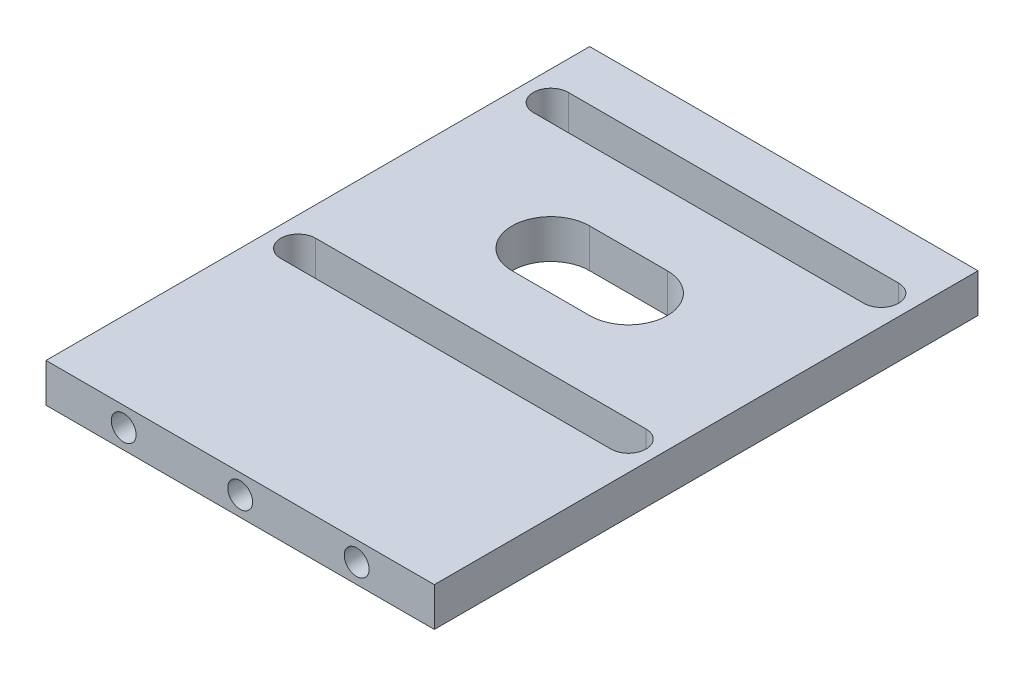
ISO-10303-21;
HEADER;
FILE_DESCRIPTION(('STEP AP214'),'2;1');
FILE_NAME('part.step','',(''),(''),'','','');
FILE_SCHEMA(('AUTOMOTIVE_DESIGN { 1 0 10303 214 1 1 1 1 }'));
ENDSEC;
DATA;
#1=APPLICATION_CONTEXT('core data for automotive mechanical design processes');
#2=APPLICATION_PROTOCOL_DEFINITION('international standard','automotive_design',2000,#1);
#3=PRODUCT_CONTEXT('',#1,'mechanical');
#4=PRODUCT('Part','Part','',(#3));
#5=PRODUCT_RELATED_PRODUCT_CATEGORY('part','',(#4));
#6=PRODUCT_DEFINITION_FORMATION('','',#4);
#7=PRODUCT_DEFINITION_CONTEXT('part definition',#1,'design');
#8=PRODUCT_DEFINITION('design','',#6,#7);
#9=PRODUCT_DEFINITION_SHAPE('','',#8);
#10=(LENGTH_UNIT() NAMED_UNIT(*) SI_UNIT(.MILLI.,.METRE.));
#11=(NAMED_UNIT(*) PLANE_ANGLE_UNIT() SI_UNIT($,.RADIAN.));
#12=(NAMED_UNIT(*) SI_UNIT($,.STERADIAN.) SOLID_ANGLE_UNIT());
#13=UNCERTAINTY_MEASURE_WITH_UNIT(LENGTH_MEASURE(1.E-05),#10,'distance_accuracy_value','');
#14=(GEOMETRIC_REPRESENTATION_CONTEXT(3) GLOBAL_UNCERTAINTY_ASSIGNED_CONTEXT((#13)) GLOBAL_UNIT_ASSIGNED_CONTEXT((#10,
#11,#12)) REPRESENTATION_CONTEXT('',''));
#15=CARTESIAN_POINT('',(0.,0.,0.));
#16=DIRECTION('',(0.,0.,1.));
#17=DIRECTION('',(1.,0.,0.));
#18=AXIS2_PLACEMENT_3D('',#15,#16,#17);
#19=CARTESIAN_POINT('',(0.,5.,0.));
#20=DIRECTION('',(0.,1.,0.));
#21=DIRECTION('',(0.,0.,1.));
#22=AXIS2_PLACEMENT_3D('',#19,#20,#21);
#23=PLANE('',#22);
#24=DIRECTION('',(0.,0.,1.));
#25=VECTOR('',#24,1.);
#26=CARTESIAN_POINT('',(-29.5750744686097,5.,-38.274395374361));
#27=LINE('',#26,#25);
#28=CARTESIAN_POINT('',(-29.5750744686097,5.,-38.274395374361));
#29=VERTEX_POINT('',#28);
#30=CARTESIAN_POINT('',(-29.5750744686097,5.,31.725604625639));
#31=VERTEX_POINT('',#30);
#32=EDGE_CURVE('E289',#29,#31,#27,.T.);
#33=ORIENTED_EDGE('',*,*,#32,.T.);
#34=DIRECTION('',(1.,0.,0.));
#35=VECTOR('',#34,1.);
#36=CARTESIAN_POINT('',(-29.5750744686097,5.,31.725604625639));
#37=LINE('',#36,#35);
#38=CARTESIAN_POINT('',(20.4249255313903,5.,31.725604625639));
#39=VERTEX_POINT('',#38);
#40=EDGE_CURVE('E293',#31,#39,#37,.T.);
#41=ORIENTED_EDGE('',*,*,#40,.T.);
#42=DIRECTION('',(0.,0.,-1.));
#43=VECTOR('',#42,1.);
#44=CARTESIAN_POINT('',(20.4249255313903,5.,-38.274395374361));
#45=LINE('',#44,#43);
#46=CARTESIAN_POINT('',(20.4249255313903,5.,-38.274395374361));
#47=VERTEX_POINT('',#46);
#48=EDGE_CURVE('E297',#39,#47,#45,.T.);
#49=ORIENTED_EDGE('',*,*,#48,.T.);
#50=DIRECTION('',(-1.,0.,0.));
#51=VECTOR('',#50,1.);
#52=CARTESIAN_POINT('',(-29.5750744686097,5.,-38.274395374361));
#53=LINE('',#52,#51);
#54=EDGE_CURVE('E300',#47,#29,#53,.T.);
#55=ORIENTED_EDGE('',*,*,#54,.T.);
#56=EDGE_LOOP('',(#33,#41,#49,#55));
#57=FACE_BOUND('',#56,.T.);
#58=DIRECTION('',(1.,0.,0.));
#59=VECTOR('',#58,1.);
#60=CARTESIAN_POINT('',(-25.8385304359003,5.,-27.2878513416516));
#61=LINE('',#60,#59);
#62=CARTESIAN_POINT('',(-25.8385304359003,5.,-27.2878513416516));
#63=VERTEX_POINT('',#62);
#64=CARTESIAN_POINT('',(16.6883814986808,5.,-27.2878513416516));
#65=VERTEX_POINT('',#64);
#66=EDGE_CURVE('E249',#63,#65,#61,.T.);
#67=ORIENTED_EDGE('',*,*,#66,.F.);
#68=CARTESIAN_POINT('',(-25.8385304359003,5.,-29.5378513416516));
#69=DIRECTION('',(0.,1.,0.));
#70=DIRECTION('',(0.,0.,1.));
#71=AXIS2_PLACEMENT_3D('',#68,#69,#70);
#72=CIRCLE('',#71,2.24999999999999);
#73=CARTESIAN_POINT('',(-25.8385304359003,5.,-31.7878513416516));
#74=VERTEX_POINT('',#73);
#75=EDGE_CURVE('E246',#74,#63,#72,.T.);
#76=ORIENTED_EDGE('',*,*,#75,.F.);
#77=DIRECTION('',(-1.,0.,0.));
#78=VECTOR('',#77,1.);
#79=CARTESIAN_POINT('',(-25.8385304359003,5.,-31.7878513416516));
#80=LINE('',#79,#78);
#81=CARTESIAN_POINT('',(16.6883814986808,5.,-31.7878513416516));
#82=VERTEX_POINT('',#81);
#83=EDGE_CURVE('E257',#82,#74,#80,.T.);
#84=ORIENTED_EDGE('',*,*,#83,.F.);
#85=CARTESIAN_POINT('',(16.6883814986808,5.,-29.5378513416516));
#86=DIRECTION('',(0.,1.,0.));
#87=DIRECTION('',(0.,0.,1.));
#88=AXIS2_PLACEMENT_3D('',#85,#86,#87);
#89=CIRCLE('',#88,2.24999999999999);
#90=EDGE_CURVE('E253',#65,#82,#89,.T.);
#91=ORIENTED_EDGE('',*,*,#90,.F.);
#92=EDGE_LOOP('',(#67,#76,#84,#91));
#93=FACE_BOUND('',#92,.T.);
#94=DIRECTION('',(1.,0.,0.));
#95=VECTOR('',#94,1.);
#96=CARTESIAN_POINT('',(-9.57507446860975,5.,-8.27439537436097));
#97=LINE('',#96,#95);
#98=CARTESIAN_POINT('',(-9.57507446860975,5.,-8.27439537436097));
#99=VERTEX_POINT('',#98);
#100=CARTESIAN_POINT('',(0.424925531390246,5.,-8.27439537436096));
#101=VERTEX_POINT('',#100);
#102=EDGE_CURVE('E206',#99,#101,#97,.T.);
#103=ORIENTED_EDGE('',*,*,#102,.F.);
#104=CARTESIAN_POINT('',(-9.57507446860975,5.,-13.274395374361));
#105=DIRECTION('',(0.,1.,0.));
#106=DIRECTION('',(0.,0.,1.));
#107=AXIS2_PLACEMENT_3D('',#104,#105,#106);
#108=CIRCLE('',#107,5.);
#109=CARTESIAN_POINT('',(-9.57507446860975,5.,-18.274395374361));
#110=VERTEX_POINT('',#109);
#111=EDGE_CURVE('E203',#110,#99,#108,.T.);
#112=ORIENTED_EDGE('',*,*,#111,.F.);
#113=DIRECTION('',(-1.,0.,0.));
#114=VECTOR('',#113,1.);
#115=CARTESIAN_POINT('',(-9.57507446860975,5.,-18.274395374361));
#116=LINE('',#115,#114);
#117=CARTESIAN_POINT('',(0.424925531390245,5.,-18.274395374361));
#118=VERTEX_POINT('',#117);
#119=EDGE_CURVE('E214',#118,#110,#116,.T.);
#120=ORIENTED_EDGE('',*,*,#119,.F.);
#121=CARTESIAN_POINT('',(0.424925531390251,5.,-13.274395374361));
#122=DIRECTION('',(0.,1.,0.));
#123=DIRECTION('',(0.,0.,1.));
#124=AXIS2_PLACEMENT_3D('',#121,#122,#123);
#125=CIRCLE('',#124,5.);
#126=EDGE_CURVE('E210',#101,#118,#125,.T.);
#127=ORIENTED_EDGE('',*,*,#126,.F.);
#128=EDGE_LOOP('',(#103,#112,#120,#127));
#129=FACE_BOUND('',#128,.T.);
#130=DIRECTION('',(1.,0.,0.));
#131=VECTOR('',#130,1.);
#132=CARTESIAN_POINT('',(-25.8385304359003,5.,5.23906059292962));
#133=LINE('',#132,#131);
#134=CARTESIAN_POINT('',(-25.8385304359003,5.,5.23906059292962));
#135=VERTEX_POINT('',#134);
#136=CARTESIAN_POINT('',(16.6883814986808,5.,5.23906059292963));
#137=VERTEX_POINT('',#136);
#138=EDGE_CURVE('E162',#135,#137,#133,.T.);
#139=ORIENTED_EDGE('',*,*,#138,.F.);
#140=CARTESIAN_POINT('',(-25.8385304359003,5.,2.98906059292963));
#141=DIRECTION('',(0.,1.,0.));
#142=DIRECTION('',(0.,0.,-1.));
#143=AXIS2_PLACEMENT_3D('',#140,#141,#142);
#144=CIRCLE('',#143,2.24999999999998);
#145=CARTESIAN_POINT('',(-25.8385304359003,5.,0.73906059292965));
#146=VERTEX_POINT('',#145);
#147=EDGE_CURVE('E153',#146,#135,#144,.T.);
#148=ORIENTED_EDGE('',*,*,#147,.F.);
#149=DIRECTION('',(-1.,0.,0.));
#150=VECTOR('',#149,1.);
#151=CARTESIAN_POINT('',(-25.8385304359003,5.,0.73906059292965));
#152=LINE('',#151,#150);
#153=CARTESIAN_POINT('',(16.6883814986808,5.,0.739060592929643));
#154=VERTEX_POINT('',#153);
#155=EDGE_CURVE('E179',#154,#146,#152,.T.);
#156=ORIENTED_EDGE('',*,*,#155,.F.);
#157=CARTESIAN_POINT('',(16.6883814986808,5.,2.98906059292963));
#158=DIRECTION('',(0.,1.,0.));
#159=DIRECTION('',(0.,0.,-1.));
#160=AXIS2_PLACEMENT_3D('',#157,#158,#159);
#161=CIRCLE('',#160,2.24999999999999);
#162=EDGE_CURVE('E175',#137,#154,#161,.T.);
#163=ORIENTED_EDGE('',*,*,#162,.F.);
#164=EDGE_LOOP('',(#139,#148,#156,#163));
#165=FACE_BOUND('',#164,.T.);
#166=ADVANCED_FACE('F39',(#57,#93,#129,#165),#23,.T.);
#167=CARTESIAN_POINT('',(0.,0.,0.));
#168=DIRECTION('',(0.,1.,0.));
#169=DIRECTION('',(0.,0.,1.));
#170=AXIS2_PLACEMENT_3D('',#167,#168,#169);
#171=PLANE('',#170);
#172=CARTESIAN_POINT('',(-9.57507446860975,0.,-13.274395374361));
#173=DIRECTION('',(0.,1.,0.));
#174=DIRECTION('',(0.,0.,1.));
#175=AXIS2_PLACEMENT_3D('',#172,#173,#174);
#176=CIRCLE('',#175,5.);
#177=CARTESIAN_POINT('',(-9.57507446860975,0.,-18.274395374361));
#178=VERTEX_POINT('',#177);
#179=CARTESIAN_POINT('',(-9.57507446860975,0.,-8.27439537436097));
#180=VERTEX_POINT('',#179);
#181=EDGE_CURVE('E171',#178,#180,#176,.T.);
#182=ORIENTED_EDGE('',*,*,#181,.T.);
#183=DIRECTION('',(1.,0.,0.));
#184=VECTOR('',#183,1.);
#185=CARTESIAN_POINT('',(-9.57507446860975,0.,-8.27439537436097));
#186=LINE('',#185,#184);
#187=CARTESIAN_POINT('',(0.424925531390246,0.,-8.27439537436096));
#188=VERTEX_POINT('',#187);
#189=EDGE_CURVE('E221',#180,#188,#186,.T.);
#190=ORIENTED_EDGE('',*,*,#189,.T.);
#191=CARTESIAN_POINT('',(0.424925531390251,0.,-13.274395374361));
#192=DIRECTION('',(0.,1.,0.));
#193=DIRECTION('',(0.,0.,1.));
#194=AXIS2_PLACEMENT_3D('',#191,#192,#193);
#195=CIRCLE('',#194,5.);
#196=CARTESIAN_POINT('',(0.424925531390245,0.,-18.274395374361));
#197=VERTEX_POINT('',#196);
#198=EDGE_CURVE('E225',#188,#197,#195,.T.);
#199=ORIENTED_EDGE('',*,*,#198,.T.);
#200=DIRECTION('',(-1.,0.,0.));
#201=VECTOR('',#200,1.);
#202=CARTESIAN_POINT('',(-9.57507446860975,0.,-18.274395374361));
#203=LINE('',#202,#201);
#204=EDGE_CURVE('E207',#197,#178,#203,.T.);
#205=ORIENTED_EDGE('',*,*,#204,.T.);
#206=EDGE_LOOP('',(#182,#190,#199,#205));
#207=FACE_BOUND('',#206,.T.);
#208=DIRECTION('',(0.,0.,1.));
#209=VECTOR('',#208,1.);
#210=CARTESIAN_POINT('',(-29.5750744686097,0.,-38.274395374361));
#211=LINE('',#210,#209);
#212=CARTESIAN_POINT('',(-29.5750744686097,0.,-38.274395374361));
#213=VERTEX_POINT('',#212);
#214=CARTESIAN_POINT('',(-29.5750744686097,0.,31.725604625639));
#215=VERTEX_POINT('',#214);
#216=EDGE_CURVE('E288',#213,#215,#211,.T.);
#217=ORIENTED_EDGE('',*,*,#216,.F.);
#218=DIRECTION('',(-1.,0.,0.));
#219=VECTOR('',#218,1.);
#220=CARTESIAN_POINT('',(-29.5750744686097,0.,-38.274395374361));
#221=LINE('',#220,#219);
#222=CARTESIAN_POINT('',(20.4249255313903,0.,-38.274395374361));
#223=VERTEX_POINT('',#222);
#224=EDGE_CURVE('E294',#223,#213,#221,.T.);
#225=ORIENTED_EDGE('',*,*,#224,.F.);
#226=DIRECTION('',(0.,0.,-1.));
#227=VECTOR('',#226,1.);
#228=CARTESIAN_POINT('',(20.4249255313903,0.,-38.274395374361));
#229=LINE('',#228,#227);
#230=CARTESIAN_POINT('',(20.4249255313903,0.,31.725604625639));
#231=VERTEX_POINT('',#230);
#232=EDGE_CURVE('E310',#231,#223,#229,.T.);
#233=ORIENTED_EDGE('',*,*,#232,.F.);
#234=DIRECTION('',(1.,0.,0.));
#235=VECTOR('',#234,1.);
#236=CARTESIAN_POINT('',(-29.5750744686097,0.,31.725604625639));
#237=LINE('',#236,#235);
#238=EDGE_CURVE('E307',#215,#231,#237,.T.);
#239=ORIENTED_EDGE('',*,*,#238,.F.);
#240=EDGE_LOOP('',(#217,#225,#233,#239));
#241=FACE_BOUND('',#240,.T.);
#242=CARTESIAN_POINT('',(-25.8385304359003,0.,-29.5378513416516));
#243=DIRECTION('',(0.,1.,0.));
#244=DIRECTION('',(0.,0.,1.));
#245=AXIS2_PLACEMENT_3D('',#242,#243,#244);
#246=CIRCLE('',#245,2.24999999999999);
#247=CARTESIAN_POINT('',(-25.8385304359003,0.,-31.7878513416516));
#248=VERTEX_POINT('',#247);
#249=CARTESIAN_POINT('',(-25.8385304359003,0.,-27.2878513416516));
#250=VERTEX_POINT('',#249);
#251=EDGE_CURVE('E245',#248,#250,#246,.T.);
#252=ORIENTED_EDGE('',*,*,#251,.T.);
#253=DIRECTION('',(1.,0.,0.));
#254=VECTOR('',#253,1.);
#255=CARTESIAN_POINT('',(-25.8385304359003,0.,-27.2878513416516));
#256=LINE('',#255,#254);
#257=CARTESIAN_POINT('',(16.6883814986808,0.,-27.2878513416516));
#258=VERTEX_POINT('',#257);
#259=EDGE_CURVE('E264',#250,#258,#256,.T.);
#260=ORIENTED_EDGE('',*,*,#259,.T.);
#261=CARTESIAN_POINT('',(16.6883814986808,0.,-29.5378513416516));
#262=DIRECTION('',(0.,1.,0.));
#263=DIRECTION('',(0.,0.,1.));
#264=AXIS2_PLACEMENT_3D('',#261,#262,#263);
#265=CIRCLE('',#264,2.24999999999999);
#266=CARTESIAN_POINT('',(16.6883814986808,0.,-31.7878513416516));
#267=VERTEX_POINT('',#266);
#268=EDGE_CURVE('E268',#258,#267,#265,.T.);
#269=ORIENTED_EDGE('',*,*,#268,.T.);
#270=DIRECTION('',(-1.,0.,0.));
#271=VECTOR('',#270,1.);
#272=CARTESIAN_POINT('',(-25.8385304359003,0.,-31.7878513416516));
#273=LINE('',#272,#271);
#274=EDGE_CURVE('E250',#267,#248,#273,.T.);
#275=ORIENTED_EDGE('',*,*,#274,.T.);
#276=EDGE_LOOP('',(#252,#260,#269,#275));
#277=FACE_BOUND('',#276,.T.);
#278=CARTESIAN_POINT('',(-25.8385304359003,0.,2.98906059292963));
#279=DIRECTION('',(0.,1.,0.));
#280=DIRECTION('',(0.,0.,-1.));
#281=AXIS2_PLACEMENT_3D('',#278,#279,#280);
#282=CIRCLE('',#281,2.24999999999998);
#283=CARTESIAN_POINT('',(-25.8385304359003,0.,0.73906059292965));
#284=VERTEX_POINT('',#283);
#285=CARTESIAN_POINT('',(-25.8385304359003,0.,5.23906059292962));
#286=VERTEX_POINT('',#285);
#287=EDGE_CURVE('E63',#284,#286,#282,.T.);
#288=ORIENTED_EDGE('',*,*,#287,.T.);
#289=DIRECTION('',(1.,0.,0.));
#290=VECTOR('',#289,1.);
#291=CARTESIAN_POINT('',(-25.8385304359003,0.,5.23906059292962));
#292=LINE('',#291,#290);
#293=CARTESIAN_POINT('',(16.6883814986808,0.,5.23906059292963));
#294=VERTEX_POINT('',#293);
#295=EDGE_CURVE('E169',#286,#294,#292,.T.);
#296=ORIENTED_EDGE('',*,*,#295,.T.);
#297=CARTESIAN_POINT('',(16.6883814986808,0.,2.98906059292963));
#298=DIRECTION('',(0.,1.,0.));
#299=DIRECTION('',(0.,0.,-1.));
#300=AXIS2_PLACEMENT_3D('',#297,#298,#299);
#301=CIRCLE('',#300,2.24999999999999);
#302=CARTESIAN_POINT('',(16.6883814986808,0.,0.739060592929643));
#303=VERTEX_POINT('',#302);
#304=EDGE_CURVE('E190',#294,#303,#301,.T.);
#305=ORIENTED_EDGE('',*,*,#304,.T.);
#306=DIRECTION('',(-1.,0.,0.));
#307=VECTOR('',#306,1.);
#308=CARTESIAN_POINT('',(-25.8385304359003,0.,0.73906059292965));
#309=LINE('',#308,#307);
#310=EDGE_CURVE('E163',#303,#284,#309,.T.);
#311=ORIENTED_EDGE('',*,*,#310,.T.);
#312=EDGE_LOOP('',(#288,#296,#305,#311));
#313=FACE_BOUND('',#312,.T.);
#314=ADVANCED_FACE('F333',(#207,#241,#277,#313),#171,.F.);
#315=CARTESIAN_POINT('',(-29.5750744686097,5.,-38.274395374361));
#316=DIRECTION('',(1.,0.,0.));
#317=DIRECTION('',(0.,0.,-1.));
#318=AXIS2_PLACEMENT_3D('',#315,#316,#317);
#319=PLANE('',#318);
#320=ORIENTED_EDGE('',*,*,#216,.T.);
#321=DIRECTION('',(0.,-1.,0.));
#322=VECTOR('',#321,1.);
#323=CARTESIAN_POINT('',(-29.5750744686097,5.,31.725604625639));
#324=LINE('',#323,#322);
#325=EDGE_CURVE('E11',#31,#215,#324,.T.);
#326=ORIENTED_EDGE('',*,*,#325,.F.);
#327=ORIENTED_EDGE('',*,*,#32,.F.);
#328=DIRECTION('',(0.,-1.,0.));
#329=VECTOR('',#328,1.);
#330=CARTESIAN_POINT('',(-29.5750744686097,5.,-38.274395374361));
#331=LINE('',#330,#329);
#332=EDGE_CURVE('E303',#29,#213,#331,.T.);
#333=ORIENTED_EDGE('',*,*,#332,.T.);
#334=EDGE_LOOP('',(#320,#326,#327,#333));
#335=FACE_BOUND('',#334,.T.);
#336=ADVANCED_FACE('F41',(#335),#319,.F.);
#337=CARTESIAN_POINT('',(-29.5750744686097,5.,31.725604625639));
#338=DIRECTION('',(0.,0.,-1.));
#339=DIRECTION('',(-1.,0.,0.));
#340=AXIS2_PLACEMENT_3D('',#337,#338,#339);
#341=PLANE('',#340);
#342=CARTESIAN_POINT('',(10.4249255313903,2.5,31.725604625639));
#343=DIRECTION('',(0.,0.,1.));
#344=DIRECTION('',(-1.,0.,0.));
#345=AXIS2_PLACEMENT_3D('',#342,#343,#344);
#346=CIRCLE('',#345,1.6);
#347=CARTESIAN_POINT('',(8.82492553139025,2.5,31.725604625639));
#348=VERTEX_POINT('',#347);
#349=EDGE_CURVE('E555',#348,#348,#346,.T.);
#350=ORIENTED_EDGE('',*,*,#349,.F.);
#351=EDGE_LOOP('',(#350));
#352=FACE_BOUND('',#351,.T.);
#353=CARTESIAN_POINT('',(-19.5750744686097,2.5,31.725604625639));
#354=DIRECTION('',(0.,0.,1.));
#355=DIRECTION('',(1.,0.,0.));
#356=AXIS2_PLACEMENT_3D('',#353,#354,#355);
#357=CIRCLE('',#356,1.6);
#358=CARTESIAN_POINT('',(-17.9750744686097,2.5,31.725604625639));
#359=VERTEX_POINT('',#358);
#360=EDGE_CURVE('E554',#359,#359,#357,.T.);
#361=ORIENTED_EDGE('',*,*,#360,.F.);
#362=EDGE_LOOP('',(#361));
#363=FACE_BOUND('',#362,.T.);
#364=CARTESIAN_POINT('',(-4.57507446860974,2.5,31.725604625639));
#365=DIRECTION('',(0.,0.,1.));
#366=DIRECTION('',(1.,0.,0.));
#367=AXIS2_PLACEMENT_3D('',#364,#365,#366);
#368=CIRCLE('',#367,1.6);
#369=CARTESIAN_POINT('',(-2.97507446860974,2.5,31.725604625639));
#370=VERTEX_POINT('',#369);
#371=EDGE_CURVE('E568',#370,#370,#368,.T.);
#372=ORIENTED_EDGE('',*,*,#371,.F.);
#373=EDGE_LOOP('',(#372));
#374=FACE_BOUND('',#373,.T.);
#375=ORIENTED_EDGE('',*,*,#238,.T.);
#376=DIRECTION('',(0.,-1.,0.));
#377=VECTOR('',#376,1.);
#378=CARTESIAN_POINT('',(20.4249255313903,5.,31.725604625639));
#379=LINE('',#378,#377);
#380=EDGE_CURVE('E48',#39,#231,#379,.T.);
#381=ORIENTED_EDGE('',*,*,#380,.F.);
#382=ORIENTED_EDGE('',*,*,#40,.F.);
#383=ORIENTED_EDGE('',*,*,#325,.T.);
#384=EDGE_LOOP('',(#375,#381,#382,#383));
#385=FACE_BOUND('',#384,.T.);
#386=ADVANCED_FACE('F344',(#352,#363,#374,#385),#341,.F.);
#387=CARTESIAN_POINT('',(20.4249255313903,5.,-38.274395374361));
#388=DIRECTION('',(-1.,0.,0.));
#389=DIRECTION('',(0.,0.,1.));
#390=AXIS2_PLACEMENT_3D('',#387,#388,#389);
#391=PLANE('',#390);
#392=ORIENTED_EDGE('',*,*,#232,.T.);
#393=DIRECTION('',(0.,-1.,0.));
#394=VECTOR('',#393,1.);
#395=CARTESIAN_POINT('',(20.4249255313903,5.,-38.274395374361));
#396=LINE('',#395,#394);
#397=EDGE_CURVE('E318',#47,#223,#396,.T.);
#398=ORIENTED_EDGE('',*,*,#397,.F.);
#399=ORIENTED_EDGE('',*,*,#48,.F.);
#400=ORIENTED_EDGE('',*,*,#380,.T.);
#401=EDGE_LOOP('',(#392,#398,#399,#400));
#402=FACE_BOUND('',#401,.T.);
#403=ADVANCED_FACE('F327',(#402),#391,.F.);
#404=CARTESIAN_POINT('',(-29.5750744686097,5.,-38.274395374361));
#405=DIRECTION('',(0.,0.,1.));
#406=DIRECTION('',(1.,0.,0.));
#407=AXIS2_PLACEMENT_3D('',#404,#405,#406);
#408=PLANE('',#407);
#409=ORIENTED_EDGE('',*,*,#224,.T.);
#410=ORIENTED_EDGE('',*,*,#332,.F.);
#411=ORIENTED_EDGE('',*,*,#54,.F.);
#412=ORIENTED_EDGE('',*,*,#397,.T.);
#413=EDGE_LOOP('',(#409,#410,#411,#412));
#414=FACE_BOUND('',#413,.T.);
#415=ADVANCED_FACE('F337',(#414),#408,.F.);
#416=CARTESIAN_POINT('',(-25.8385304359003,5.,-29.5378513416516));
#417=DIRECTION('',(0.,-1.,0.));
#418=DIRECTION('',(0.,0.,-1.));
#419=AXIS2_PLACEMENT_3D('',#416,#417,#418);
#420=CYLINDRICAL_SURFACE('',#419,2.24999999999999);
#421=ORIENTED_EDGE('',*,*,#251,.F.);
#422=DIRECTION('',(0.,-1.,0.));
#423=VECTOR('',#422,1.);
#424=CARTESIAN_POINT('',(-25.8385304359003,5.,-31.7878513416516));
#425=LINE('',#424,#423);
#426=EDGE_CURVE('E260',#74,#248,#425,.T.);
#427=ORIENTED_EDGE('',*,*,#426,.F.);
#428=ORIENTED_EDGE('',*,*,#75,.T.);
#429=DIRECTION('',(0.,-1.,0.));
#430=VECTOR('',#429,1.);
#431=CARTESIAN_POINT('',(-25.8385304359003,5.,-27.2878513416516));
#432=LINE('',#431,#430);
#433=EDGE_CURVE('E284',#63,#250,#432,.T.);
#434=ORIENTED_EDGE('',*,*,#433,.T.);
#435=EDGE_LOOP('',(#421,#427,#428,#434));
#436=FACE_BOUND('',#435,.T.);
#437=ADVANCED_FACE('F362',(#436),#420,.F.);
#438=CARTESIAN_POINT('',(-25.8385304359003,5.,-27.2878513416516));
#439=DIRECTION('',(0.,0.,-1.));
#440=DIRECTION('',(-1.,0.,0.));
#441=AXIS2_PLACEMENT_3D('',#438,#439,#440);
#442=PLANE('',#441);
#443=ORIENTED_EDGE('',*,*,#259,.F.);
#444=ORIENTED_EDGE('',*,*,#433,.F.);
#445=ORIENTED_EDGE('',*,*,#66,.T.);
#446=DIRECTION('',(0.,-1.,0.));
#447=VECTOR('',#446,1.);
#448=CARTESIAN_POINT('',(16.6883814986808,5.,-27.2878513416516));
#449=LINE('',#448,#447);
#450=EDGE_CURVE('E281',#65,#258,#449,.T.);
#451=ORIENTED_EDGE('',*,*,#450,.T.);
#452=EDGE_LOOP('',(#443,#444,#445,#451));
#453=FACE_BOUND('',#452,.T.);
#454=ADVANCED_FACE('F369',(#453),#442,.T.);
#455=CARTESIAN_POINT('',(16.6883814986808,5.,-29.5378513416516));
#456=DIRECTION('',(0.,-1.,0.));
#457=DIRECTION('',(0.,0.,-1.));
#458=AXIS2_PLACEMENT_3D('',#455,#456,#457);
#459=CYLINDRICAL_SURFACE('',#458,2.24999999999999);
#460=ORIENTED_EDGE('',*,*,#268,.F.);
#461=ORIENTED_EDGE('',*,*,#450,.F.);
#462=ORIENTED_EDGE('',*,*,#90,.T.);
#463=DIRECTION('',(0.,-1.,0.));
#464=VECTOR('',#463,1.);
#465=CARTESIAN_POINT('',(16.6883814986808,5.,-31.7878513416516));
#466=LINE('',#465,#464);
#467=EDGE_CURVE('E278',#82,#267,#466,.T.);
#468=ORIENTED_EDGE('',*,*,#467,.T.);
#469=EDGE_LOOP('',(#460,#461,#462,#468));
#470=FACE_BOUND('',#469,.T.);
#471=ADVANCED_FACE('F374',(#470),#459,.F.);
#472=CARTESIAN_POINT('',(-25.8385304359003,5.,-31.7878513416516));
#473=DIRECTION('',(0.,0.,1.));
#474=DIRECTION('',(1.,0.,0.));
#475=AXIS2_PLACEMENT_3D('',#472,#473,#474);
#476=PLANE('',#475);
#477=ORIENTED_EDGE('',*,*,#274,.F.);
#478=ORIENTED_EDGE('',*,*,#467,.F.);
#479=ORIENTED_EDGE('',*,*,#83,.T.);
#480=ORIENTED_EDGE('',*,*,#426,.T.);
#481=EDGE_LOOP('',(#477,#478,#479,#480));
#482=FACE_BOUND('',#481,.T.);
#483=ADVANCED_FACE('F381',(#482),#476,.T.);
#484=CARTESIAN_POINT('',(-9.57507446860975,5.,-13.274395374361));
#485=DIRECTION('',(0.,-1.,0.));
#486=DIRECTION('',(0.,0.,-1.));
#487=AXIS2_PLACEMENT_3D('',#484,#485,#486);
#488=CYLINDRICAL_SURFACE('',#487,5.);
#489=ORIENTED_EDGE('',*,*,#181,.F.);
#490=DIRECTION('',(0.,-1.,0.));
#491=VECTOR('',#490,1.);
#492=CARTESIAN_POINT('',(-9.57507446860975,5.,-18.274395374361));
#493=LINE('',#492,#491);
#494=EDGE_CURVE('E217',#110,#178,#493,.T.);
#495=ORIENTED_EDGE('',*,*,#494,.F.);
#496=ORIENTED_EDGE('',*,*,#111,.T.);
#497=DIRECTION('',(0.,-1.,0.));
#498=VECTOR('',#497,1.);
#499=CARTESIAN_POINT('',(-9.57507446860975,5.,-8.27439537436097));
#500=LINE('',#499,#498);
#501=EDGE_CURVE('E241',#99,#180,#500,.T.);
#502=ORIENTED_EDGE('',*,*,#501,.T.);
#503=EDGE_LOOP('',(#489,#495,#496,#502));
#504=FACE_BOUND('',#503,.T.);
#505=ADVANCED_FACE('F403',(#504),#488,.F.);
#506=CARTESIAN_POINT('',(-9.57507446860975,5.,-8.27439537436097));
#507=DIRECTION('',(0.,0.,-1.));
#508=DIRECTION('',(-1.,0.,0.));
#509=AXIS2_PLACEMENT_3D('',#506,#507,#508);
#510=PLANE('',#509);
#511=ORIENTED_EDGE('',*,*,#189,.F.);
#512=ORIENTED_EDGE('',*,*,#501,.F.);
#513=ORIENTED_EDGE('',*,*,#102,.T.);
#514=DIRECTION('',(0.,-1.,0.));
#515=VECTOR('',#514,1.);
#516=CARTESIAN_POINT('',(0.424925531390246,5.,-8.27439537436096));
#517=LINE('',#516,#515);
#518=EDGE_CURVE('E238',#101,#188,#517,.T.);
#519=ORIENTED_EDGE('',*,*,#518,.T.);
#520=EDGE_LOOP('',(#511,#512,#513,#519));
#521=FACE_BOUND('',#520,.T.);
#522=ADVANCED_FACE('F397',(#521),#510,.T.);
#523=CARTESIAN_POINT('',(0.424925531390251,5.,-13.274395374361));
#524=DIRECTION('',(0.,-1.,0.));
#525=DIRECTION('',(0.,0.,-1.));
#526=AXIS2_PLACEMENT_3D('',#523,#524,#525);
#527=CYLINDRICAL_SURFACE('',#526,5.);
#528=ORIENTED_EDGE('',*,*,#198,.F.);
#529=ORIENTED_EDGE('',*,*,#518,.F.);
#530=ORIENTED_EDGE('',*,*,#126,.T.);
#531=DIRECTION('',(0.,-1.,0.));
#532=VECTOR('',#531,1.);
#533=CARTESIAN_POINT('',(0.424925531390245,5.,-18.274395374361));
#534=LINE('',#533,#532);
#535=EDGE_CURVE('E235',#118,#197,#534,.T.);
#536=ORIENTED_EDGE('',*,*,#535,.T.);
#537=EDGE_LOOP('',(#528,#529,#530,#536));
#538=FACE_BOUND('',#537,.T.);
#539=ADVANCED_FACE('F400',(#538),#527,.F.);
#540=CARTESIAN_POINT('',(-9.57507446860975,5.,-18.274395374361));
#541=DIRECTION('',(0.,0.,1.));
#542=DIRECTION('',(1.,0.,0.));
#543=AXIS2_PLACEMENT_3D('',#540,#541,#542);
#544=PLANE('',#543);
#545=ORIENTED_EDGE('',*,*,#204,.F.);
#546=ORIENTED_EDGE('',*,*,#535,.F.);
#547=ORIENTED_EDGE('',*,*,#119,.T.);
#548=ORIENTED_EDGE('',*,*,#494,.T.);
#549=EDGE_LOOP('',(#545,#546,#547,#548));
#550=FACE_BOUND('',#549,.T.);
#551=ADVANCED_FACE('F406',(#550),#544,.T.);
#552=CARTESIAN_POINT('',(-25.8385304359003,5.,2.98906059292963));
#553=DIRECTION('',(0.,-1.,0.));
#554=DIRECTION('',(0.,0.,-1.));
#555=AXIS2_PLACEMENT_3D('',#552,#553,#554);
#556=CYLINDRICAL_SURFACE('',#555,2.24999999999998);
#557=ORIENTED_EDGE('',*,*,#287,.F.);
#558=DIRECTION('',(0.,-1.,0.));
#559=VECTOR('',#558,1.);
#560=CARTESIAN_POINT('',(-25.8385304359003,5.,0.73906059292965));
#561=LINE('',#560,#559);
#562=EDGE_CURVE('E157',#146,#284,#561,.T.);
#563=ORIENTED_EDGE('',*,*,#562,.F.);
#564=ORIENTED_EDGE('',*,*,#147,.T.);
#565=DIRECTION('',(0.,-1.,0.));
#566=VECTOR('',#565,1.);
#567=CARTESIAN_POINT('',(-25.8385304359003,5.,5.23906059292962));
#568=LINE('',#567,#566);
#569=EDGE_CURVE('E156',#135,#286,#568,.T.);
#570=ORIENTED_EDGE('',*,*,#569,.T.);
#571=EDGE_LOOP('',(#557,#563,#564,#570));
#572=FACE_BOUND('',#571,.T.);
#573=ADVANCED_FACE('F155',(#572),#556,.F.);
#574=CARTESIAN_POINT('',(-25.8385304359003,5.,5.23906059292962));
#575=DIRECTION('',(0.,0.,-1.));
#576=DIRECTION('',(-1.,0.,0.));
#577=AXIS2_PLACEMENT_3D('',#574,#575,#576);
#578=PLANE('',#577);
#579=ORIENTED_EDGE('',*,*,#295,.F.);
#580=ORIENTED_EDGE('',*,*,#569,.F.);
#581=ORIENTED_EDGE('',*,*,#138,.T.);
#582=DIRECTION('',(0.,-1.,0.));
#583=VECTOR('',#582,1.);
#584=CARTESIAN_POINT('',(16.6883814986808,5.,5.23906059292963));
#585=LINE('',#584,#583);
#586=EDGE_CURVE('E172',#137,#294,#585,.T.);
#587=ORIENTED_EDGE('',*,*,#586,.T.);
#588=EDGE_LOOP('',(#579,#580,#581,#587));
#589=FACE_BOUND('',#588,.T.);
#590=ADVANCED_FACE('F166',(#589),#578,.T.);
#591=CARTESIAN_POINT('',(16.6883814986808,5.,2.98906059292963));
#592=DIRECTION('',(0.,-1.,0.));
#593=DIRECTION('',(0.,0.,-1.));
#594=AXIS2_PLACEMENT_3D('',#591,#592,#593);
#595=CYLINDRICAL_SURFACE('',#594,2.24999999999999);
#596=ORIENTED_EDGE('',*,*,#304,.F.);
#597=ORIENTED_EDGE('',*,*,#586,.F.);
#598=ORIENTED_EDGE('',*,*,#162,.T.);
#599=DIRECTION('',(0.,-1.,0.));
#600=VECTOR('',#599,1.);
#601=CARTESIAN_POINT('',(16.6883814986808,5.,0.739060592929643));
#602=LINE('',#601,#600);
#603=EDGE_CURVE('E55',#154,#303,#602,.T.);
#604=ORIENTED_EDGE('',*,*,#603,.T.);
#605=EDGE_LOOP('',(#596,#597,#598,#604));
#606=FACE_BOUND('',#605,.T.);
#607=ADVANCED_FACE('F463',(#606),#595,.F.);
#608=CARTESIAN_POINT('',(-25.8385304359003,5.,0.73906059292965));
#609=DIRECTION('',(0.,0.,1.));
#610=DIRECTION('',(1.,0.,0.));
#611=AXIS2_PLACEMENT_3D('',#608,#609,#610);
#612=PLANE('',#611);
#613=ORIENTED_EDGE('',*,*,#310,.F.);
#614=ORIENTED_EDGE('',*,*,#603,.F.);
#615=ORIENTED_EDGE('',*,*,#155,.T.);
#616=ORIENTED_EDGE('',*,*,#562,.T.);
#617=EDGE_LOOP('',(#613,#614,#615,#616));
#618=FACE_BOUND('',#617,.T.);
#619=ADVANCED_FACE('F471',(#618),#612,.T.);
#620=CARTESIAN_POINT('',(-4.57507446860974,2.5,21.725604625639));
#621=DIRECTION('',(0.,0.,1.));
#622=DIRECTION('',(1.,0.,0.));
#623=AXIS2_PLACEMENT_3D('',#620,#621,#622);
#624=CYLINDRICAL_SURFACE('',#623,1.6);
#625=CARTESIAN_POINT('',(-4.57507446860974,2.5,21.725604625639));
#626=DIRECTION('',(0.,0.,1.));
#627=DIRECTION('',(1.,0.,0.));
#628=AXIS2_PLACEMENT_3D('',#625,#626,#627);
#629=CIRCLE('',#628,1.6);
#630=CARTESIAN_POINT('',(-2.97507446860974,2.5,21.725604625639));
#631=VERTEX_POINT('',#630);
#632=EDGE_CURVE('E187',#631,#631,#629,.T.);
#633=ORIENTED_EDGE('',*,*,#632,.F.);
#634=EDGE_LOOP('',(#633));
#635=FACE_BOUND('',#634,.T.);
#636=ORIENTED_EDGE('',*,*,#371,.T.);
#637=EDGE_LOOP('',(#636));
#638=FACE_BOUND('',#637,.T.);
#639=ADVANCED_FACE('F480',(#635,#638),#624,.F.);
#640=CARTESIAN_POINT('',(-4.57507446860974,2.5,21.725604625639));
#641=DIRECTION('',(0.,0.,1.));
#642=DIRECTION('',(1.,0.,0.));
#643=AXIS2_PLACEMENT_3D('',#640,#641,#642);
#644=PLANE('',#643);
#645=ORIENTED_EDGE('',*,*,#632,.T.);
#646=EDGE_LOOP('',(#645));
#647=FACE_BOUND('',#646,.T.);
#648=ADVANCED_FACE('F496',(#647),#644,.T.);
#649=CARTESIAN_POINT('',(-19.5750744686097,2.5,21.725604625639));
#650=DIRECTION('',(0.,0.,1.));
#651=DIRECTION('',(1.,0.,0.));
#652=AXIS2_PLACEMENT_3D('',#649,#650,#651);
#653=CYLINDRICAL_SURFACE('',#652,1.6);
#654=CARTESIAN_POINT('',(-19.5750744686097,2.5,21.725604625639));
#655=DIRECTION('',(0.,0.,1.));
#656=DIRECTION('',(1.,0.,0.));
#657=AXIS2_PLACEMENT_3D('',#654,#655,#656);
#658=CIRCLE('',#657,1.6);
#659=CARTESIAN_POINT('',(-17.9750744686097,2.5,21.725604625639));
#660=VERTEX_POINT('',#659);
#661=EDGE_CURVE('E560',#660,#660,#658,.T.);
#662=ORIENTED_EDGE('',*,*,#661,.F.);
#663=EDGE_LOOP('',(#662));
#664=FACE_BOUND('',#663,.T.);
#665=ORIENTED_EDGE('',*,*,#360,.T.);
#666=EDGE_LOOP('',(#665));
#667=FACE_BOUND('',#666,.T.);
#668=ADVANCED_FACE('F506',(#664,#667),#653,.F.);
#669=CARTESIAN_POINT('',(-19.5750744686097,2.5,21.725604625639));
#670=DIRECTION('',(0.,0.,1.));
#671=DIRECTION('',(1.,0.,0.));
#672=AXIS2_PLACEMENT_3D('',#669,#670,#671);
#673=PLANE('',#672);
#674=ORIENTED_EDGE('',*,*,#661,.T.);
#675=EDGE_LOOP('',(#674));
#676=FACE_BOUND('',#675,.T.);
#677=ADVANCED_FACE('F516',(#676),#673,.T.);
#678=CARTESIAN_POINT('',(10.4249255313903,2.5,21.725604625639));
#679=DIRECTION('',(0.,0.,1.));
#680=DIRECTION('',(1.,0.,0.));
#681=AXIS2_PLACEMENT_3D('',#678,#679,#680);
#682=CYLINDRICAL_SURFACE('',#681,1.6);
#683=CARTESIAN_POINT('',(10.4249255313903,2.5,21.725604625639));
#684=DIRECTION('',(0.,0.,1.));
#685=DIRECTION('',(-1.,0.,0.));
#686=AXIS2_PLACEMENT_3D('',#683,#684,#685);
#687=CIRCLE('',#686,1.6);
#688=CARTESIAN_POINT('',(8.82492553139025,2.5,21.725604625639));
#689=VERTEX_POINT('',#688);
#690=EDGE_CURVE('E552',#689,#689,#687,.T.);
#691=ORIENTED_EDGE('',*,*,#690,.F.);
#692=EDGE_LOOP('',(#691));
#693=FACE_BOUND('',#692,.T.);
#694=ORIENTED_EDGE('',*,*,#349,.T.);
#695=EDGE_LOOP('',(#694));
#696=FACE_BOUND('',#695,.T.);
#697=ADVANCED_FACE('F526',(#693,#696),#682,.F.);
#698=CARTESIAN_POINT('',(10.4249255313903,2.5,21.725604625639));
#699=DIRECTION('',(0.,0.,-1.));
#700=DIRECTION('',(-1.,0.,0.));
#701=AXIS2_PLACEMENT_3D('',#698,#699,#700);
#702=PLANE('',#701);
#703=ORIENTED_EDGE('',*,*,#690,.T.);
#704=EDGE_LOOP('',(#703));
#705=FACE_BOUND('',#704,.T.);
#706=ADVANCED_FACE('F536',(#705),#702,.F.);
#707=CLOSED_SHELL('',(#166,#314,#336,#386,#403,#415,#437,#454,#471,#483,#505,#522,#539,#551,
#573,#590,#607,#619,#639,#648,#668,#677,#697,#706));
#708=MANIFOLD_SOLID_BREP('B2',#707);
#709=ADVANCED_BREP_SHAPE_REPRESENTATION('',(#18,#708),#14);
#710=SHAPE_DEFINITION_REPRESENTATION(#9,#709);
ENDSEC;
END-ISO-10303-21;
